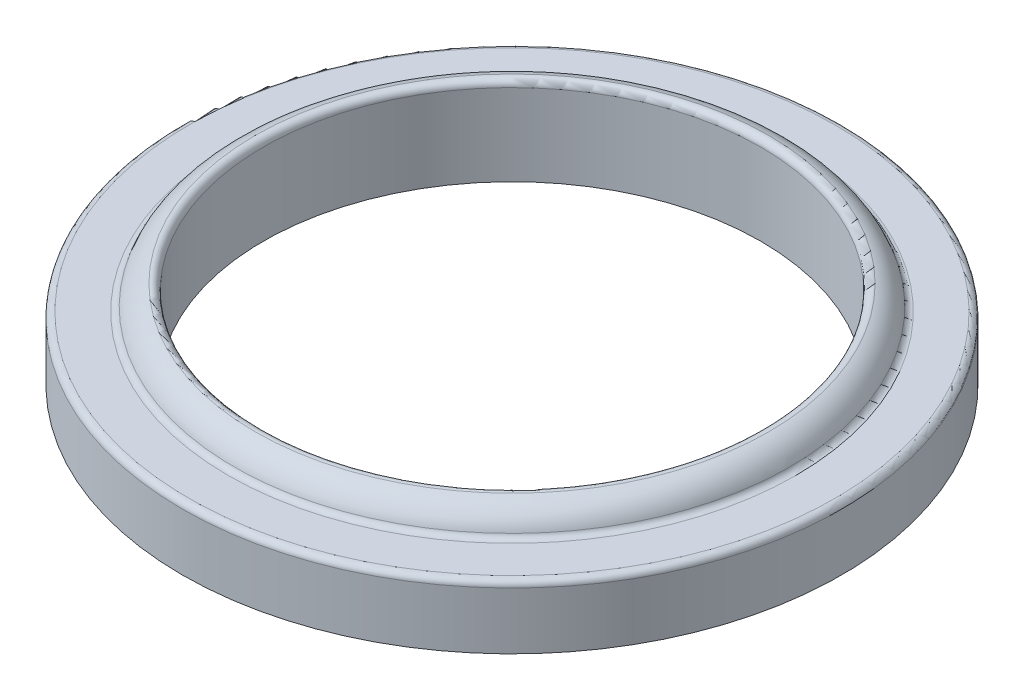
ISO-10303-21;
HEADER;
FILE_DESCRIPTION(('STEP AP214'),'2;1');
FILE_NAME('part.step','',(''),(''),'','','');
FILE_SCHEMA(('AUTOMOTIVE_DESIGN { 1 0 10303 214 1 1 1 1 }'));
ENDSEC;
DATA;
#1=APPLICATION_CONTEXT('core data for automotive mechanical design processes');
#2=APPLICATION_PROTOCOL_DEFINITION('international standard','automotive_design',2000,#1);
#3=PRODUCT_CONTEXT('',#1,'mechanical');
#4=PRODUCT('Part','Part','',(#3));
#5=PRODUCT_RELATED_PRODUCT_CATEGORY('part','',(#4));
#6=PRODUCT_DEFINITION_FORMATION('','',#4);
#7=PRODUCT_DEFINITION_CONTEXT('part definition',#1,'design');
#8=PRODUCT_DEFINITION('design','',#6,#7);
#9=PRODUCT_DEFINITION_SHAPE('','',#8);
#10=(LENGTH_UNIT() NAMED_UNIT(*) SI_UNIT(.MILLI.,.METRE.));
#11=(NAMED_UNIT(*) PLANE_ANGLE_UNIT() SI_UNIT($,.RADIAN.));
#12=(NAMED_UNIT(*) SI_UNIT($,.STERADIAN.) SOLID_ANGLE_UNIT());
#13=UNCERTAINTY_MEASURE_WITH_UNIT(LENGTH_MEASURE(1.E-05),#10,'distance_accuracy_value','');
#14=(GEOMETRIC_REPRESENTATION_CONTEXT(3) GLOBAL_UNCERTAINTY_ASSIGNED_CONTEXT((#13)) GLOBAL_UNIT_ASSIGNED_CONTEXT((#10,
#11,#12)) REPRESENTATION_CONTEXT('',''));
#15=CARTESIAN_POINT('',(0.,0.,0.));
#16=DIRECTION('',(0.,0.,1.));
#17=DIRECTION('',(1.,0.,0.));
#18=AXIS2_PLACEMENT_3D('',#15,#16,#17);
#19=CARTESIAN_POINT('',(-13.208,0.,0.));
#20=DIRECTION('',(0.,1.,0.));
#21=DIRECTION('',(0.,0.,1.));
#22=AXIS2_PLACEMENT_3D('',#19,#20,#21);
#23=PLANE('',#22);
#24=CARTESIAN_POINT('',(0.,0.,0.));
#25=DIRECTION('',(0.,-1.,0.));
#26=DIRECTION('',(0.,0.,-1.));
#27=AXIS2_PLACEMENT_3D('',#24,#25,#26);
#28=CIRCLE('',#27,9.9695);
#29=CARTESIAN_POINT('',(0.,0.,-9.9695));
#30=VERTEX_POINT('',#29);
#31=EDGE_CURVE('E56',#30,#30,#28,.T.);
#32=ORIENTED_EDGE('',*,*,#31,.F.);
#33=EDGE_LOOP('',(#32));
#34=FACE_BOUND('',#33,.T.);
#35=CARTESIAN_POINT('',(0.,0.,0.));
#36=DIRECTION('',(0.,-1.,0.));
#37=DIRECTION('',(0.,0.,-1.));
#38=AXIS2_PLACEMENT_3D('',#35,#36,#37);
#39=CIRCLE('',#38,13.208);
#40=CARTESIAN_POINT('',(0.,0.,-13.208));
#41=VERTEX_POINT('',#40);
#42=EDGE_CURVE('E59',#41,#41,#39,.T.);
#43=ORIENTED_EDGE('',*,*,#42,.T.);
#44=EDGE_LOOP('',(#43));
#45=FACE_BOUND('',#44,.T.);
#46=ADVANCED_FACE('F30',(#34,#45),#23,.F.);
#47=CARTESIAN_POINT('',(0.,0.,0.));
#48=DIRECTION('',(0.,-1.,0.));
#49=DIRECTION('',(0.,0.,-1.));
#50=AXIS2_PLACEMENT_3D('',#47,#48,#49);
#51=CYLINDRICAL_SURFACE('',#50,9.9695);
#52=CARTESIAN_POINT('',(0.,3.26816682145709,0.));
#53=DIRECTION('',(0.,1.,0.));
#54=DIRECTION('',(0.,0.,1.));
#55=AXIS2_PLACEMENT_3D('',#52,#53,#54);
#56=CIRCLE('',#55,9.9695);
#57=CARTESIAN_POINT('',(0.,3.26816682145709,9.9695));
#58=VERTEX_POINT('',#57);
#59=EDGE_CURVE('E45',#58,#58,#56,.T.);
#60=ORIENTED_EDGE('',*,*,#59,.T.);
#61=EDGE_LOOP('',(#60));
#62=FACE_BOUND('',#61,.T.);
#63=ORIENTED_EDGE('',*,*,#31,.T.);
#64=EDGE_LOOP('',(#63));
#65=FACE_BOUND('',#64,.T.);
#66=ADVANCED_FACE('F80',(#62,#65),#51,.F.);
#67=CARTESIAN_POINT('',(0.,2.331640625,0.));
#68=DIRECTION('',(0.,-1.,0.));
#69=DIRECTION('',(0.,0.,-1.));
#70=AXIS2_PLACEMENT_3D('',#67,#68,#69);
#71=TOROIDAL_SURFACE('',#70,9.9695,1.224359375);
#72=CARTESIAN_POINT('',(0.,3.51331069292213,0.));
#73=DIRECTION('',(0.,-1.,0.));
#74=DIRECTION('',(0.,0.,-1.));
#75=AXIS2_PLACEMENT_3D('',#72,#73,#74);
#76=CIRCLE('',#75,10.2899867075664);
#77=CARTESIAN_POINT('',(0.,3.51331069292213,-10.2899867075664));
#78=VERTEX_POINT('',#77);
#79=EDGE_CURVE('E50',#78,#78,#76,.T.);
#80=ORIENTED_EDGE('',*,*,#79,.T.);
#81=EDGE_LOOP('',(#80));
#82=FACE_BOUND('',#81,.T.);
#83=CARTESIAN_POINT('',(0.,2.7145610738255,0.));
#84=DIRECTION('',(0.,-1.,0.));
#85=DIRECTION('',(0.,0.,-1.));
#86=AXIS2_PLACEMENT_3D('',#83,#84,#85);
#87=CIRCLE('',#86,11.1324392972213);
#88=CARTESIAN_POINT('',(0.,2.7145610738255,-11.1324392972213));
#89=VERTEX_POINT('',#88);
#90=EDGE_CURVE('E53',#89,#89,#87,.F.);
#91=ORIENTED_EDGE('',*,*,#90,.T.);
#92=EDGE_LOOP('',(#91));
#93=FACE_BOUND('',#92,.T.);
#94=ADVANCED_FACE('F77',(#82,#93),#71,.T.);
#95=CARTESIAN_POINT('',(-11.176,2.54,0.));
#96=DIRECTION('',(0.,-1.,0.));
#97=DIRECTION('',(0.,0.,-1.));
#98=AXIS2_PLACEMENT_3D('',#95,#96,#97);
#99=PLANE('',#98);
#100=CARTESIAN_POINT('',(0.,2.54,0.));
#101=DIRECTION('',(0.,-1.,0.));
#102=DIRECTION('',(0.,0.,-1.));
#103=AXIS2_PLACEMENT_3D('',#100,#101,#102);
#104=CIRCLE('',#103,12.954);
#105=CARTESIAN_POINT('',(0.,2.54,-12.954));
#106=VERTEX_POINT('',#105);
#107=EDGE_CURVE('E10',#106,#106,#104,.F.);
#108=ORIENTED_EDGE('',*,*,#107,.T.);
#109=EDGE_LOOP('',(#108));
#110=FACE_BOUND('',#109,.T.);
#111=CARTESIAN_POINT('',(0.,2.54,0.));
#112=DIRECTION('',(0.,-1.,0.));
#113=DIRECTION('',(0.,0.,-1.));
#114=AXIS2_PLACEMENT_3D('',#111,#112,#113);
#115=CIRCLE('',#114,11.373697368606);
#116=CARTESIAN_POINT('',(0.,2.54,-11.373697368606));
#117=VERTEX_POINT('',#116);
#118=EDGE_CURVE('E37',#117,#117,#115,.T.);
#119=ORIENTED_EDGE('',*,*,#118,.T.);
#120=EDGE_LOOP('',(#119));
#121=FACE_BOUND('',#120,.T.);
#122=ADVANCED_FACE('F67',(#110,#121),#99,.F.);
#123=CARTESIAN_POINT('',(0.,0.,0.));
#124=DIRECTION('',(0.,-1.,0.));
#125=DIRECTION('',(0.,0.,-1.));
#126=AXIS2_PLACEMENT_3D('',#123,#124,#125);
#127=CYLINDRICAL_SURFACE('',#126,13.208);
#128=CARTESIAN_POINT('',(0.,2.286,0.));
#129=DIRECTION('',(0.,-1.,0.));
#130=DIRECTION('',(0.,0.,-1.));
#131=AXIS2_PLACEMENT_3D('',#128,#129,#130);
#132=CIRCLE('',#131,13.208);
#133=CARTESIAN_POINT('',(0.,2.286,-13.208));
#134=VERTEX_POINT('',#133);
#135=EDGE_CURVE('E41',#134,#134,#132,.T.);
#136=ORIENTED_EDGE('',*,*,#135,.T.);
#137=EDGE_LOOP('',(#136));
#138=FACE_BOUND('',#137,.T.);
#139=ORIENTED_EDGE('',*,*,#42,.F.);
#140=EDGE_LOOP('',(#139));
#141=FACE_BOUND('',#140,.T.);
#142=ADVANCED_FACE('F64',(#138,#141),#127,.T.);
#143=CARTESIAN_POINT('',(0.,3.26816682145709,0.));
#144=DIRECTION('',(0.,1.,0.));
#145=DIRECTION('',(0.,0.,1.));
#146=AXIS2_PLACEMENT_3D('',#143,#144,#145);
#147=TOROIDAL_SURFACE('',#146,10.2235,0.254);
#148=ORIENTED_EDGE('',*,*,#59,.F.);
#149=EDGE_LOOP('',(#148));
#150=FACE_BOUND('',#149,.T.);
#151=ORIENTED_EDGE('',*,*,#79,.F.);
#152=EDGE_LOOP('',(#151));
#153=FACE_BOUND('',#152,.T.);
#154=ADVANCED_FACE('F66',(#150,#153),#147,.T.);
#155=CARTESIAN_POINT('',(0.,2.286,0.));
#156=DIRECTION('',(0.,-1.,0.));
#157=DIRECTION('',(0.,0.,-1.));
#158=AXIS2_PLACEMENT_3D('',#155,#156,#157);
#159=TOROIDAL_SURFACE('',#158,12.954,0.254);
#160=ORIENTED_EDGE('',*,*,#107,.F.);
#161=EDGE_LOOP('',(#160));
#162=FACE_BOUND('',#161,.T.);
#163=ORIENTED_EDGE('',*,*,#135,.F.);
#164=EDGE_LOOP('',(#163));
#165=FACE_BOUND('',#164,.T.);
#166=ADVANCED_FACE('F74',(#162,#165),#159,.T.);
#167=CARTESIAN_POINT('',(0.,2.794,0.));
#168=DIRECTION('',(0.,-1.,0.));
#169=DIRECTION('',(0.,0.,-1.));
#170=AXIS2_PLACEMENT_3D('',#167,#168,#169);
#171=TOROIDAL_SURFACE('',#170,11.373697368606,0.254);
#172=ORIENTED_EDGE('',*,*,#90,.F.);
#173=EDGE_LOOP('',(#172));
#174=FACE_BOUND('',#173,.T.);
#175=ORIENTED_EDGE('',*,*,#118,.F.);
#176=EDGE_LOOP('',(#175));
#177=FACE_BOUND('',#176,.T.);
#178=ADVANCED_FACE('F32',(#174,#177),#171,.F.);
#179=CLOSED_SHELL('',(#46,#66,#94,#122,#142,#154,#166,#178));
#180=MANIFOLD_SOLID_BREP('B2',#179);
#181=ADVANCED_BREP_SHAPE_REPRESENTATION('',(#18,#180),#14);
#182=SHAPE_DEFINITION_REPRESENTATION(#9,#181);
ENDSEC;
END-ISO-10303-21;
